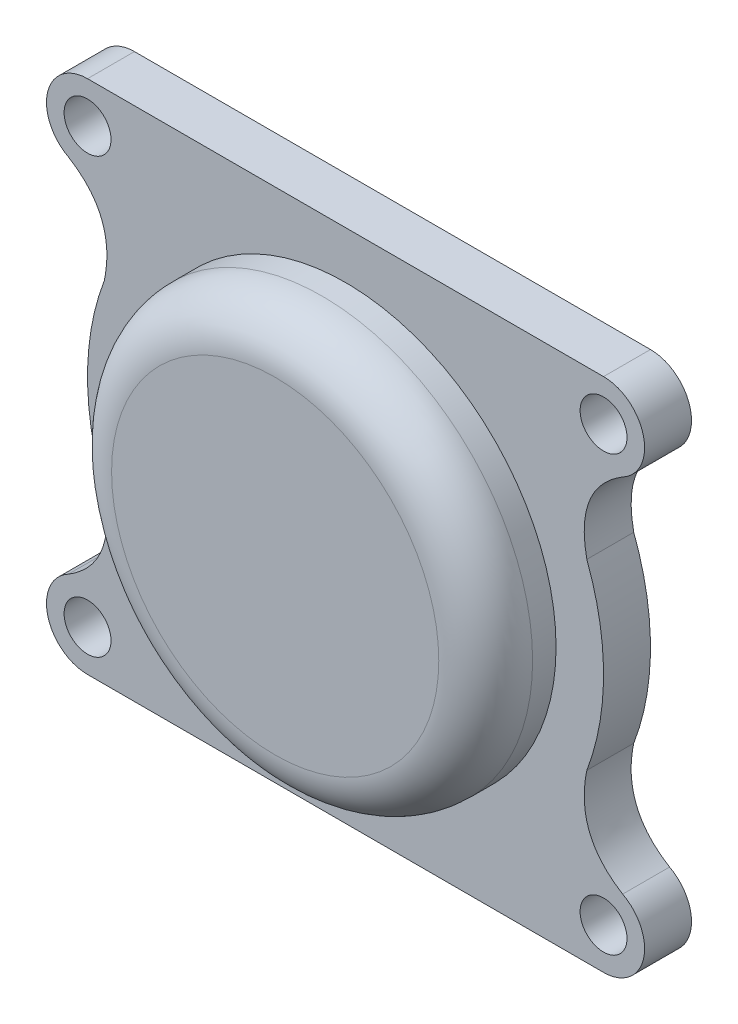
ISO-10303-21;
HEADER;
FILE_DESCRIPTION(('STEP AP214'),'2;1');
FILE_NAME('part.step','',(''),(''),'','','');
FILE_SCHEMA(('AUTOMOTIVE_DESIGN { 1 0 10303 214 1 1 1 1 }'));
ENDSEC;
DATA;
#1=APPLICATION_CONTEXT('core data for automotive mechanical design processes');
#2=APPLICATION_PROTOCOL_DEFINITION('international standard','automotive_design',2000,#1);
#3=PRODUCT_CONTEXT('',#1,'mechanical');
#4=PRODUCT('Part','Part','',(#3));
#5=PRODUCT_RELATED_PRODUCT_CATEGORY('part','',(#4));
#6=PRODUCT_DEFINITION_FORMATION('','',#4);
#7=PRODUCT_DEFINITION_CONTEXT('part definition',#1,'design');
#8=PRODUCT_DEFINITION('design','',#6,#7);
#9=PRODUCT_DEFINITION_SHAPE('','',#8);
#10=(LENGTH_UNIT() NAMED_UNIT(*) SI_UNIT(.MILLI.,.METRE.));
#11=(NAMED_UNIT(*) PLANE_ANGLE_UNIT() SI_UNIT($,.RADIAN.));
#12=(NAMED_UNIT(*) SI_UNIT($,.STERADIAN.) SOLID_ANGLE_UNIT());
#13=UNCERTAINTY_MEASURE_WITH_UNIT(LENGTH_MEASURE(1.E-05),#10,'distance_accuracy_value','');
#14=(GEOMETRIC_REPRESENTATION_CONTEXT(3) GLOBAL_UNCERTAINTY_ASSIGNED_CONTEXT((#13)) GLOBAL_UNIT_ASSIGNED_CONTEXT((#10,
#11,#12)) REPRESENTATION_CONTEXT('',''));
#15=CARTESIAN_POINT('',(0.,0.,0.));
#16=DIRECTION('',(0.,0.,1.));
#17=DIRECTION('',(1.,0.,0.));
#18=AXIS2_PLACEMENT_3D('',#15,#16,#17);
#19=CARTESIAN_POINT('',(-10.8666362557918,8.84990876735196,2.));
#20=DIRECTION('',(0.,0.,1.));
#21=DIRECTION('',(1.,0.,0.));
#22=AXIS2_PLACEMENT_3D('',#19,#20,#21);
#23=PLANE('',#22);
#24=CARTESIAN_POINT('',(-10.8666362557918,8.84990876735196,2.));
#25=DIRECTION('',(0.,0.,1.));
#26=DIRECTION('',(1.,0.,0.));
#27=AXIS2_PLACEMENT_3D('',#24,#25,#26);
#28=CIRCLE('',#27,1.);
#29=CARTESIAN_POINT('',(-9.86663625579182,8.84990876735196,2.));
#30=VERTEX_POINT('',#29);
#31=EDGE_CURVE('E341',#30,#30,#28,.T.);
#32=ORIENTED_EDGE('',*,*,#31,.F.);
#33=EDGE_LOOP('',(#32));
#34=FACE_BOUND('',#33,.T.);
#35=CARTESIAN_POINT('',(-10.8666362557918,-9.65009123264805,2.));
#36=DIRECTION('',(0.,0.,1.));
#37=DIRECTION('',(1.,0.,0.));
#38=AXIS2_PLACEMENT_3D('',#35,#36,#37);
#39=CIRCLE('',#38,0.999999999999998);
#40=CARTESIAN_POINT('',(-9.86663625579182,-9.65009123264805,2.));
#41=VERTEX_POINT('',#40);
#42=EDGE_CURVE('E166',#41,#41,#39,.T.);
#43=ORIENTED_EDGE('',*,*,#42,.F.);
#44=EDGE_LOOP('',(#43));
#45=FACE_BOUND('',#44,.T.);
#46=CARTESIAN_POINT('',(-10.8666362557918,8.84990876735196,2.));
#47=DIRECTION('',(0.,0.,1.));
#48=DIRECTION('',(1.,0.,0.));
#49=AXIS2_PLACEMENT_3D('',#46,#47,#48);
#50=CIRCLE('',#49,1.75000000003128);
#51=CARTESIAN_POINT('',(-10.8666362557918,10.5999087673832,2.));
#52=VERTEX_POINT('',#51);
#53=CARTESIAN_POINT('',(-11.6821574732259,7.30154668296523,2.));
#54=VERTEX_POINT('',#53);
#55=EDGE_CURVE('E205',#52,#54,#50,.T.);
#56=ORIENTED_EDGE('',*,*,#55,.T.);
#57=CARTESIAN_POINT('',(-896790.598267621,-442476.793929693,2.));
#58=CARTESIAN_POINT('',(895703.235486702,444637.410012307,2.));
#59=CARTESIAN_POINT('',(-894657.315377021,-446774.30900078,2.));
#60=B_SPLINE_CURVE_WITH_KNOTS('',2,(#57,#58,#59),.UNSPECIFIED.,.F.,.F.,(3,3),(0.,1.),.UNSPECIFIED.);
#61=CARTESIAN_POINT('',(-10.1540505189162,3.4946626448175,2.));
#62=VERTEX_POINT('',#61);
#63=EDGE_CURVE('E110',#54,#62,#60,.T.);
#64=ORIENTED_EDGE('',*,*,#63,.T.);
#65=CARTESIAN_POINT('',(0.133363744208179,-0.400091232648048,2.));
#66=DIRECTION('',(0.,0.,1.));
#67=DIRECTION('',(1.,0.,0.));
#68=AXIS2_PLACEMENT_3D('',#65,#66,#67);
#69=CIRCLE('',#68,10.9999999994168);
#70=CARTESIAN_POINT('',(-10.1540505353681,-4.29484505079547,2.));
#71=VERTEX_POINT('',#70);
#72=EDGE_CURVE('E305',#62,#71,#69,.T.);
#73=ORIENTED_EDGE('',*,*,#72,.T.);
#74=CARTESIAN_POINT('',(-894657.315377453,446773.508817446,2.));
#75=CARTESIAN_POINT('',(895703.235486702,-444638.210194769,2.));
#76=CARTESIAN_POINT('',(-896790.598267197,442475.993748083,2.));
#77=B_SPLINE_CURVE_WITH_KNOTS('',2,(#74,#75,#76),.UNSPECIFIED.,.F.,.F.,(3,3),(0.,1.),.UNSPECIFIED.);
#78=CARTESIAN_POINT('',(-11.6821574745311,-8.10172914910089,2.));
#79=VERTEX_POINT('',#78);
#80=EDGE_CURVE('E300',#71,#79,#77,.T.);
#81=ORIENTED_EDGE('',*,*,#80,.T.);
#82=CARTESIAN_POINT('',(-10.8666362557918,-9.65009123264805,2.));
#83=DIRECTION('',(0.,0.,1.));
#84=DIRECTION('',(1.,0.,0.));
#85=AXIS2_PLACEMENT_3D('',#82,#83,#84);
#86=CIRCLE('',#85,1.74999999999442);
#87=CARTESIAN_POINT('',(-10.8666362557918,-11.400091232643,2.));
#88=VERTEX_POINT('',#87);
#89=EDGE_CURVE('E298',#79,#88,#86,.T.);
#90=ORIENTED_EDGE('',*,*,#89,.T.);
#91=DIRECTION('',(1.,-2.31270179774544E-13,0.));
#92=VECTOR('',#91,1.);
#93=CARTESIAN_POINT('',(-10.8666362557918,-11.400091232643,2.));
#94=LINE('',#93,#92);
#95=CARTESIAN_POINT('',(11.1333637442082,-11.4000912326599,2.));
#96=VERTEX_POINT('',#95);
#97=EDGE_CURVE('E296',#88,#96,#94,.T.);
#98=ORIENTED_EDGE('',*,*,#97,.T.);
#99=CARTESIAN_POINT('',(11.1333637442082,-9.65009123264805,2.));
#100=DIRECTION('',(0.,0.,1.));
#101=DIRECTION('',(1.,0.,0.));
#102=AXIS2_PLACEMENT_3D('',#99,#100,#101);
#103=CIRCLE('',#102,1.75000000001188);
#104=CARTESIAN_POINT('',(11.9488849615484,-8.10172914834861,2.));
#105=VERTEX_POINT('',#104);
#106=EDGE_CURVE('E291',#96,#105,#103,.T.);
#107=ORIENTED_EDGE('',*,*,#106,.T.);
#108=CARTESIAN_POINT('',(896790.86499509,442475.993747267,2.));
#109=CARTESIAN_POINT('',(-895702.968759215,-444638.210194769,2.));
#110=CARTESIAN_POINT('',(894657.582104532,446773.508818268,2.));
#111=B_SPLINE_CURVE_WITH_KNOTS('',2,(#108,#109,#110),.UNSPECIFIED.,.F.,.F.,(3,3),(0.,1.),.UNSPECIFIED.);
#112=CARTESIAN_POINT('',(10.420778007214,-4.29484511008255,2.));
#113=VERTEX_POINT('',#112);
#114=EDGE_CURVE('E286',#105,#113,#111,.T.);
#115=ORIENTED_EDGE('',*,*,#114,.T.);
#116=CARTESIAN_POINT('',(0.133363744208179,-0.400091232648048,2.));
#117=DIRECTION('',(0.,0.,1.));
#118=DIRECTION('',(1.,0.,0.));
#119=AXIS2_PLACEMENT_3D('',#116,#117,#118);
#120=CIRCLE('',#119,10.9999999992948);
#121=CARTESIAN_POINT('',(10.4207780235742,3.49466258545728,2.));
#122=VERTEX_POINT('',#121);
#123=EDGE_CURVE('E141',#113,#122,#120,.T.);
#124=ORIENTED_EDGE('',*,*,#123,.T.);
#125=CARTESIAN_POINT('',(894657.582104965,-446774.308999863,2.));
#126=CARTESIAN_POINT('',(-895702.968759213,444637.410012306,2.));
#127=CARTESIAN_POINT('',(896790.864994659,-442476.793930601,2.));
#128=B_SPLINE_CURVE_WITH_KNOTS('',2,(#125,#126,#127),.UNSPECIFIED.,.F.,.F.,(3,3),(0.,1.),.UNSPECIFIED.);
#129=CARTESIAN_POINT('',(11.948884962921,7.30154668376602,2.));
#130=VERTEX_POINT('',#129);
#131=EDGE_CURVE('E135',#122,#130,#128,.T.);
#132=ORIENTED_EDGE('',*,*,#131,.T.);
#133=CARTESIAN_POINT('',(11.1333637442082,8.84990876735196,2.));
#134=DIRECTION('',(0.,0.,1.));
#135=DIRECTION('',(1.,0.,0.));
#136=AXIS2_PLACEMENT_3D('',#133,#134,#135);
#137=CIRCLE('',#136,1.75000000001643);
#138=CARTESIAN_POINT('',(11.1333637442082,10.5999087673483,2.));
#139=VERTEX_POINT('',#138);
#140=EDGE_CURVE('E139',#130,#139,#137,.T.);
#141=ORIENTED_EDGE('',*,*,#140,.T.);
#142=DIRECTION('',(-1.,1.58900670399476E-12,0.));
#143=VECTOR('',#142,1.);
#144=CARTESIAN_POINT('',(11.1333637442082,10.5999087673483,2.));
#145=LINE('',#144,#143);
#146=EDGE_CURVE('E54',#139,#52,#145,.T.);
#147=ORIENTED_EDGE('',*,*,#146,.T.);
#148=EDGE_LOOP('',(#56,#64,#73,#81,#90,#98,#107,#115,#124,#132,#141,#147));
#149=FACE_BOUND('',#148,.T.);
#150=CARTESIAN_POINT('',(11.1333637442082,-9.65009123264805,2.));
#151=DIRECTION('',(0.,0.,1.));
#152=DIRECTION('',(1.,0.,0.));
#153=AXIS2_PLACEMENT_3D('',#150,#151,#152);
#154=CIRCLE('',#153,1.);
#155=CARTESIAN_POINT('',(12.1333637442082,-9.65009123264805,2.));
#156=VERTEX_POINT('',#155);
#157=EDGE_CURVE('E335',#156,#156,#154,.T.);
#158=ORIENTED_EDGE('',*,*,#157,.F.);
#159=EDGE_LOOP('',(#158));
#160=FACE_BOUND('',#159,.T.);
#161=CARTESIAN_POINT('',(11.1333637442082,8.84990876735196,2.));
#162=DIRECTION('',(0.,0.,1.));
#163=DIRECTION('',(1.,0.,0.));
#164=AXIS2_PLACEMENT_3D('',#161,#162,#163);
#165=CIRCLE('',#164,1.00000000000001);
#166=CARTESIAN_POINT('',(12.1333637442082,8.84990876735196,2.));
#167=VERTEX_POINT('',#166);
#168=EDGE_CURVE('E347',#167,#167,#165,.T.);
#169=ORIENTED_EDGE('',*,*,#168,.F.);
#170=EDGE_LOOP('',(#169));
#171=FACE_BOUND('',#170,.T.);
#172=CARTESIAN_POINT('',(0.133363744208179,-0.400091232648048,2.));
#173=DIRECTION('',(0.,0.,1.));
#174=DIRECTION('',(1.,0.,0.));
#175=AXIS2_PLACEMENT_3D('',#172,#173,#174);
#176=CIRCLE('',#175,8.975);
#177=CARTESIAN_POINT('',(9.10836374420817,-0.400091232648048,2.));
#178=VERTEX_POINT('',#177);
#179=EDGE_CURVE('E358',#178,#178,#176,.T.);
#180=ORIENTED_EDGE('',*,*,#179,.F.);
#181=EDGE_LOOP('',(#180));
#182=FACE_BOUND('',#181,.T.);
#183=ADVANCED_FACE('F37',(#34,#45,#149,#160,#171,#182),#23,.T.);
#184=CARTESIAN_POINT('',(-10.8666362557918,8.84990876735196,0.));
#185=DIRECTION('',(0.,0.,1.));
#186=DIRECTION('',(1.,0.,0.));
#187=AXIS2_PLACEMENT_3D('',#184,#185,#186);
#188=PLANE('',#187);
#189=CARTESIAN_POINT('',(-10.8666362557918,8.84990876735196,0.));
#190=DIRECTION('',(0.,0.,1.));
#191=DIRECTION('',(1.,0.,0.));
#192=AXIS2_PLACEMENT_3D('',#189,#190,#191);
#193=CIRCLE('',#192,1.75000000003128);
#194=CARTESIAN_POINT('',(-10.8666362557918,10.5999087673832,0.));
#195=VERTEX_POINT('',#194);
#196=CARTESIAN_POINT('',(-11.6821574732259,7.30154668296523,0.));
#197=VERTEX_POINT('',#196);
#198=EDGE_CURVE('E162',#195,#197,#193,.T.);
#199=ORIENTED_EDGE('',*,*,#198,.F.);
#200=DIRECTION('',(-1.,1.58900670399476E-12,0.));
#201=VECTOR('',#200,1.);
#202=CARTESIAN_POINT('',(11.1333637442082,10.5999087673483,0.));
#203=LINE('',#202,#201);
#204=CARTESIAN_POINT('',(11.1333637442082,10.5999087673483,0.));
#205=VERTEX_POINT('',#204);
#206=EDGE_CURVE('E101',#205,#195,#203,.T.);
#207=ORIENTED_EDGE('',*,*,#206,.F.);
#208=CARTESIAN_POINT('',(11.1333637442082,8.84990876735196,0.));
#209=DIRECTION('',(0.,0.,1.));
#210=DIRECTION('',(1.,0.,0.));
#211=AXIS2_PLACEMENT_3D('',#208,#209,#210);
#212=CIRCLE('',#211,1.75000000001643);
#213=CARTESIAN_POINT('',(11.948884962921,7.30154668376602,0.));
#214=VERTEX_POINT('',#213);
#215=EDGE_CURVE('E95',#214,#205,#212,.T.);
#216=ORIENTED_EDGE('',*,*,#215,.F.);
#217=CARTESIAN_POINT('',(894657.582104965,-446774.308999863,0.));
#218=CARTESIAN_POINT('',(-895702.968759213,444637.410012306,0.));
#219=CARTESIAN_POINT('',(896790.864994659,-442476.793930601,0.));
#220=B_SPLINE_CURVE_WITH_KNOTS('',2,(#217,#218,#219),.UNSPECIFIED.,.F.,.F.,(3,3),(0.,1.),.UNSPECIFIED.);
#221=CARTESIAN_POINT('',(10.4207780235742,3.49466258545728,0.));
#222=VERTEX_POINT('',#221);
#223=EDGE_CURVE('E149',#222,#214,#220,.T.);
#224=ORIENTED_EDGE('',*,*,#223,.F.);
#225=CARTESIAN_POINT('',(0.133363744208179,-0.400091232648048,0.));
#226=DIRECTION('',(0.,0.,1.));
#227=DIRECTION('',(1.,0.,0.));
#228=AXIS2_PLACEMENT_3D('',#225,#226,#227);
#229=CIRCLE('',#228,10.9999999992948);
#230=CARTESIAN_POINT('',(10.420778007214,-4.29484511008255,0.));
#231=VERTEX_POINT('',#230);
#232=EDGE_CURVE('E192',#231,#222,#229,.T.);
#233=ORIENTED_EDGE('',*,*,#232,.F.);
#234=CARTESIAN_POINT('',(896790.86499509,442475.993747267,0.));
#235=CARTESIAN_POINT('',(-895702.968759215,-444638.210194769,0.));
#236=CARTESIAN_POINT('',(894657.582104532,446773.508818268,0.));
#237=B_SPLINE_CURVE_WITH_KNOTS('',2,(#234,#235,#236),.UNSPECIFIED.,.F.,.F.,(3,3),(0.,1.),.UNSPECIFIED.);
#238=CARTESIAN_POINT('',(11.9488849615484,-8.10172914834861,0.));
#239=VERTEX_POINT('',#238);
#240=EDGE_CURVE('E188',#239,#231,#237,.T.);
#241=ORIENTED_EDGE('',*,*,#240,.F.);
#242=CARTESIAN_POINT('',(11.1333637442082,-9.65009123264805,0.));
#243=DIRECTION('',(0.,0.,1.));
#244=DIRECTION('',(1.,0.,0.));
#245=AXIS2_PLACEMENT_3D('',#242,#243,#244);
#246=CIRCLE('',#245,1.75000000001188);
#247=CARTESIAN_POINT('',(11.1333637442082,-11.4000912326599,0.));
#248=VERTEX_POINT('',#247);
#249=EDGE_CURVE('E186',#248,#239,#246,.T.);
#250=ORIENTED_EDGE('',*,*,#249,.F.);
#251=DIRECTION('',(1.,-2.31270179774544E-13,0.));
#252=VECTOR('',#251,1.);
#253=CARTESIAN_POINT('',(-10.8666362557918,-11.400091232643,0.));
#254=LINE('',#253,#252);
#255=CARTESIAN_POINT('',(-10.8666362557918,-11.400091232643,0.));
#256=VERTEX_POINT('',#255);
#257=EDGE_CURVE('E184',#256,#248,#254,.T.);
#258=ORIENTED_EDGE('',*,*,#257,.F.);
#259=CARTESIAN_POINT('',(-10.8666362557918,-9.65009123264805,0.));
#260=DIRECTION('',(0.,0.,1.));
#261=DIRECTION('',(1.,0.,0.));
#262=AXIS2_PLACEMENT_3D('',#259,#260,#261);
#263=CIRCLE('',#262,1.74999999999442);
#264=CARTESIAN_POINT('',(-11.6821574745311,-8.10172914910089,0.));
#265=VERTEX_POINT('',#264);
#266=EDGE_CURVE('E179',#265,#256,#263,.T.);
#267=ORIENTED_EDGE('',*,*,#266,.F.);
#268=CARTESIAN_POINT('',(-894657.315377453,446773.508817446,0.));
#269=CARTESIAN_POINT('',(895703.235486702,-444638.210194769,0.));
#270=CARTESIAN_POINT('',(-896790.598267197,442475.993748083,0.));
#271=B_SPLINE_CURVE_WITH_KNOTS('',2,(#268,#269,#270),.UNSPECIFIED.,.F.,.F.,(3,3),(0.,1.),.UNSPECIFIED.);
#272=CARTESIAN_POINT('',(-10.1540505353681,-4.29484505079547,0.));
#273=VERTEX_POINT('',#272);
#274=EDGE_CURVE('E175',#273,#265,#271,.T.);
#275=ORIENTED_EDGE('',*,*,#274,.F.);
#276=CARTESIAN_POINT('',(0.133363744208179,-0.400091232648048,0.));
#277=DIRECTION('',(0.,0.,1.));
#278=DIRECTION('',(1.,0.,0.));
#279=AXIS2_PLACEMENT_3D('',#276,#277,#278);
#280=CIRCLE('',#279,10.9999999994168);
#281=CARTESIAN_POINT('',(-10.1540505189162,3.4946626448175,0.));
#282=VERTEX_POINT('',#281);
#283=EDGE_CURVE('E170',#282,#273,#280,.T.);
#284=ORIENTED_EDGE('',*,*,#283,.F.);
#285=CARTESIAN_POINT('',(-896790.598267621,-442476.793929693,0.));
#286=CARTESIAN_POINT('',(895703.235486702,444637.410012307,0.));
#287=CARTESIAN_POINT('',(-894657.315377021,-446774.30900078,0.));
#288=B_SPLINE_CURVE_WITH_KNOTS('',2,(#285,#286,#287),.UNSPECIFIED.,.F.,.F.,(3,3),(0.,1.),.UNSPECIFIED.);
#289=EDGE_CURVE('E165',#197,#282,#288,.T.);
#290=ORIENTED_EDGE('',*,*,#289,.F.);
#291=EDGE_LOOP('',(#199,#207,#216,#224,#233,#241,#250,#258,#267,#275,#284,#290));
#292=FACE_BOUND('',#291,.T.);
#293=CARTESIAN_POINT('',(-10.8666362557918,-9.65009123264805,0.));
#294=DIRECTION('',(0.,0.,1.));
#295=DIRECTION('',(1.,0.,0.));
#296=AXIS2_PLACEMENT_3D('',#293,#294,#295);
#297=CIRCLE('',#296,0.999999999999998);
#298=CARTESIAN_POINT('',(-9.86663625579182,-9.65009123264805,0.));
#299=VERTEX_POINT('',#298);
#300=EDGE_CURVE('E332',#299,#299,#297,.T.);
#301=ORIENTED_EDGE('',*,*,#300,.T.);
#302=EDGE_LOOP('',(#301));
#303=FACE_BOUND('',#302,.T.);
#304=CARTESIAN_POINT('',(11.1333637442082,-9.65009123264805,0.));
#305=DIRECTION('',(0.,0.,1.));
#306=DIRECTION('',(1.,0.,0.));
#307=AXIS2_PLACEMENT_3D('',#304,#305,#306);
#308=CIRCLE('',#307,1.);
#309=CARTESIAN_POINT('',(12.1333637442082,-9.65009123264805,0.));
#310=VERTEX_POINT('',#309);
#311=EDGE_CURVE('E338',#310,#310,#308,.T.);
#312=ORIENTED_EDGE('',*,*,#311,.T.);
#313=EDGE_LOOP('',(#312));
#314=FACE_BOUND('',#313,.T.);
#315=CARTESIAN_POINT('',(-10.8666362557918,8.84990876735196,0.));
#316=DIRECTION('',(0.,0.,1.));
#317=DIRECTION('',(1.,0.,0.));
#318=AXIS2_PLACEMENT_3D('',#315,#316,#317);
#319=CIRCLE('',#318,1.);
#320=CARTESIAN_POINT('',(-9.86663625579182,8.84990876735196,0.));
#321=VERTEX_POINT('',#320);
#322=EDGE_CURVE('E344',#321,#321,#319,.T.);
#323=ORIENTED_EDGE('',*,*,#322,.T.);
#324=EDGE_LOOP('',(#323));
#325=FACE_BOUND('',#324,.T.);
#326=CARTESIAN_POINT('',(11.1333637442082,8.84990876735196,0.));
#327=DIRECTION('',(0.,0.,1.));
#328=DIRECTION('',(1.,0.,0.));
#329=AXIS2_PLACEMENT_3D('',#326,#327,#328);
#330=CIRCLE('',#329,1.00000000000001);
#331=CARTESIAN_POINT('',(12.1333637442082,8.84990876735196,0.));
#332=VERTEX_POINT('',#331);
#333=EDGE_CURVE('E350',#332,#332,#330,.T.);
#334=ORIENTED_EDGE('',*,*,#333,.T.);
#335=EDGE_LOOP('',(#334));
#336=FACE_BOUND('',#335,.T.);
#337=CARTESIAN_POINT('',(0.133363744208179,-0.400091232648048,0.));
#338=DIRECTION('',(0.,0.,1.));
#339=DIRECTION('',(1.,0.,0.));
#340=AXIS2_PLACEMENT_3D('',#337,#338,#339);
#341=CIRCLE('',#340,7.975);
#342=CARTESIAN_POINT('',(8.10836374420817,-0.400091232648048,0.));
#343=VERTEX_POINT('',#342);
#344=EDGE_CURVE('E353',#343,#343,#341,.T.);
#345=ORIENTED_EDGE('',*,*,#344,.T.);
#346=EDGE_LOOP('',(#345));
#347=FACE_BOUND('',#346,.T.);
#348=ADVANCED_FACE('F253',(#292,#303,#314,#325,#336,#347),#188,.F.);
#349=CARTESIAN_POINT('',(-10.8666362557918,8.84990876735196,2.));
#350=DIRECTION('',(0.,0.,-1.));
#351=DIRECTION('',(-1.,0.,0.));
#352=AXIS2_PLACEMENT_3D('',#349,#350,#351);
#353=CYLINDRICAL_SURFACE('',#352,1.75000000003128);
#354=ORIENTED_EDGE('',*,*,#198,.T.);
#355=DIRECTION('',(0.,0.,-1.));
#356=VECTOR('',#355,1.);
#357=CARTESIAN_POINT('',(-11.6821574732259,7.30154668296523,2.));
#358=LINE('',#357,#356);
#359=EDGE_CURVE('E230',#54,#197,#358,.T.);
#360=ORIENTED_EDGE('',*,*,#359,.F.);
#361=ORIENTED_EDGE('',*,*,#55,.F.);
#362=DIRECTION('',(0.,0.,-1.));
#363=VECTOR('',#362,1.);
#364=CARTESIAN_POINT('',(-10.8666362557918,10.5999087673832,2.));
#365=LINE('',#364,#363);
#366=EDGE_CURVE('E155',#52,#195,#365,.T.);
#367=ORIENTED_EDGE('',*,*,#366,.T.);
#368=EDGE_LOOP('',(#354,#360,#361,#367));
#369=FACE_BOUND('',#368,.T.);
#370=ADVANCED_FACE('F259',(#369),#353,.T.);
#371=DIRECTION('',(0.,0.,-1.));
#372=VECTOR('',#371,1.);
#373=SURFACE_OF_LINEAR_EXTRUSION('',#60,#372);
#374=ORIENTED_EDGE('',*,*,#289,.T.);
#375=DIRECTION('',(0.,0.,-1.));
#376=VECTOR('',#375,1.);
#377=CARTESIAN_POINT('',(-10.1540505189162,3.4946626448175,2.));
#378=LINE('',#377,#376);
#379=EDGE_CURVE('E227',#62,#282,#378,.T.);
#380=ORIENTED_EDGE('',*,*,#379,.F.);
#381=ORIENTED_EDGE('',*,*,#63,.F.);
#382=ORIENTED_EDGE('',*,*,#359,.T.);
#383=EDGE_LOOP('',(#374,#380,#381,#382));
#384=FACE_BOUND('',#383,.T.);
#385=ADVANCED_FACE('F320',(#384),#373,.F.);
#386=CARTESIAN_POINT('',(0.133363744208179,-0.400091232648048,2.));
#387=DIRECTION('',(0.,0.,-1.));
#388=DIRECTION('',(-1.,0.,0.));
#389=AXIS2_PLACEMENT_3D('',#386,#387,#388);
#390=CYLINDRICAL_SURFACE('',#389,10.9999999994168);
#391=ORIENTED_EDGE('',*,*,#283,.T.);
#392=DIRECTION('',(0.,0.,-1.));
#393=VECTOR('',#392,1.);
#394=CARTESIAN_POINT('',(-10.1540505353681,-4.29484505079547,2.));
#395=LINE('',#394,#393);
#396=EDGE_CURVE('E224',#71,#273,#395,.T.);
#397=ORIENTED_EDGE('',*,*,#396,.F.);
#398=ORIENTED_EDGE('',*,*,#72,.F.);
#399=ORIENTED_EDGE('',*,*,#379,.T.);
#400=EDGE_LOOP('',(#391,#397,#398,#399));
#401=FACE_BOUND('',#400,.T.);
#402=ADVANCED_FACE('F316',(#401),#390,.T.);
#403=DIRECTION('',(0.,0.,-1.));
#404=VECTOR('',#403,1.);
#405=SURFACE_OF_LINEAR_EXTRUSION('',#77,#404);
#406=ORIENTED_EDGE('',*,*,#274,.T.);
#407=DIRECTION('',(0.,0.,-1.));
#408=VECTOR('',#407,1.);
#409=CARTESIAN_POINT('',(-11.6821574745311,-8.10172914910089,2.));
#410=LINE('',#409,#408);
#411=EDGE_CURVE('E221',#79,#265,#410,.T.);
#412=ORIENTED_EDGE('',*,*,#411,.F.);
#413=ORIENTED_EDGE('',*,*,#80,.F.);
#414=ORIENTED_EDGE('',*,*,#396,.T.);
#415=EDGE_LOOP('',(#406,#412,#413,#414));
#416=FACE_BOUND('',#415,.T.);
#417=ADVANCED_FACE('F311',(#416),#405,.F.);
#418=CARTESIAN_POINT('',(-10.8666362557918,-9.65009123264805,2.));
#419=DIRECTION('',(0.,0.,-1.));
#420=DIRECTION('',(-1.,0.,0.));
#421=AXIS2_PLACEMENT_3D('',#418,#419,#420);
#422=CYLINDRICAL_SURFACE('',#421,1.74999999999442);
#423=ORIENTED_EDGE('',*,*,#266,.T.);
#424=DIRECTION('',(0.,0.,-1.));
#425=VECTOR('',#424,1.);
#426=CARTESIAN_POINT('',(-10.8666362557918,-11.400091232643,2.));
#427=LINE('',#426,#425);
#428=EDGE_CURVE('E218',#88,#256,#427,.T.);
#429=ORIENTED_EDGE('',*,*,#428,.F.);
#430=ORIENTED_EDGE('',*,*,#89,.F.);
#431=ORIENTED_EDGE('',*,*,#411,.T.);
#432=EDGE_LOOP('',(#423,#429,#430,#431));
#433=FACE_BOUND('',#432,.T.);
#434=ADVANCED_FACE('F315',(#433),#422,.T.);
#435=CARTESIAN_POINT('',(-10.8666362557918,-11.400091232643,2.));
#436=DIRECTION('',(2.31270179774544E-13,1.,0.));
#437=DIRECTION('',(-1.,2.31270179774544E-13,0.));
#438=AXIS2_PLACEMENT_3D('',#435,#436,#437);
#439=PLANE('',#438);
#440=ORIENTED_EDGE('',*,*,#257,.T.);
#441=DIRECTION('',(0.,0.,-1.));
#442=VECTOR('',#441,1.);
#443=CARTESIAN_POINT('',(11.1333637442082,-11.4000912326599,2.));
#444=LINE('',#443,#442);
#445=EDGE_CURVE('E215',#96,#248,#444,.T.);
#446=ORIENTED_EDGE('',*,*,#445,.F.);
#447=ORIENTED_EDGE('',*,*,#97,.F.);
#448=ORIENTED_EDGE('',*,*,#428,.T.);
#449=EDGE_LOOP('',(#440,#446,#447,#448));
#450=FACE_BOUND('',#449,.T.);
#451=ADVANCED_FACE('F437',(#450),#439,.F.);
#452=CARTESIAN_POINT('',(11.1333637442082,-9.65009123264805,2.));
#453=DIRECTION('',(0.,0.,-1.));
#454=DIRECTION('',(-1.,0.,0.));
#455=AXIS2_PLACEMENT_3D('',#452,#453,#454);
#456=CYLINDRICAL_SURFACE('',#455,1.75000000001188);
#457=ORIENTED_EDGE('',*,*,#249,.T.);
#458=DIRECTION('',(0.,0.,-1.));
#459=VECTOR('',#458,1.);
#460=CARTESIAN_POINT('',(11.9488849615484,-8.10172914834861,2.));
#461=LINE('',#460,#459);
#462=EDGE_CURVE('E212',#105,#239,#461,.T.);
#463=ORIENTED_EDGE('',*,*,#462,.F.);
#464=ORIENTED_EDGE('',*,*,#106,.F.);
#465=ORIENTED_EDGE('',*,*,#445,.T.);
#466=EDGE_LOOP('',(#457,#463,#464,#465));
#467=FACE_BOUND('',#466,.T.);
#468=ADVANCED_FACE('F283',(#467),#456,.T.);
#469=DIRECTION('',(0.,0.,-1.));
#470=VECTOR('',#469,1.);
#471=SURFACE_OF_LINEAR_EXTRUSION('',#111,#470);
#472=ORIENTED_EDGE('',*,*,#240,.T.);
#473=DIRECTION('',(0.,0.,-1.));
#474=VECTOR('',#473,1.);
#475=CARTESIAN_POINT('',(10.420778007214,-4.29484511008255,2.));
#476=LINE('',#475,#474);
#477=EDGE_CURVE('E209',#113,#231,#476,.T.);
#478=ORIENTED_EDGE('',*,*,#477,.F.);
#479=ORIENTED_EDGE('',*,*,#114,.F.);
#480=ORIENTED_EDGE('',*,*,#462,.T.);
#481=EDGE_LOOP('',(#472,#478,#479,#480));
#482=FACE_BOUND('',#481,.T.);
#483=ADVANCED_FACE('F278',(#482),#471,.F.);
#484=CARTESIAN_POINT('',(0.133363744208179,-0.400091232648048,2.));
#485=DIRECTION('',(0.,0.,-1.));
#486=DIRECTION('',(-1.,0.,0.));
#487=AXIS2_PLACEMENT_3D('',#484,#485,#486);
#488=CYLINDRICAL_SURFACE('',#487,10.9999999992948);
#489=ORIENTED_EDGE('',*,*,#232,.T.);
#490=DIRECTION('',(0.,0.,-1.));
#491=VECTOR('',#490,1.);
#492=CARTESIAN_POINT('',(10.4207780235742,3.49466258545728,2.));
#493=LINE('',#492,#491);
#494=EDGE_CURVE('E150',#122,#222,#493,.T.);
#495=ORIENTED_EDGE('',*,*,#494,.F.);
#496=ORIENTED_EDGE('',*,*,#123,.F.);
#497=ORIENTED_EDGE('',*,*,#477,.T.);
#498=EDGE_LOOP('',(#489,#495,#496,#497));
#499=FACE_BOUND('',#498,.T.);
#500=ADVANCED_FACE('F275',(#499),#488,.T.);
#501=DIRECTION('',(0.,0.,-1.));
#502=VECTOR('',#501,1.);
#503=SURFACE_OF_LINEAR_EXTRUSION('',#128,#502);
#504=ORIENTED_EDGE('',*,*,#223,.T.);
#505=DIRECTION('',(0.,0.,-1.));
#506=VECTOR('',#505,1.);
#507=CARTESIAN_POINT('',(11.948884962921,7.30154668376602,2.));
#508=LINE('',#507,#506);
#509=EDGE_CURVE('E146',#130,#214,#508,.T.);
#510=ORIENTED_EDGE('',*,*,#509,.F.);
#511=ORIENTED_EDGE('',*,*,#131,.F.);
#512=ORIENTED_EDGE('',*,*,#494,.T.);
#513=EDGE_LOOP('',(#504,#510,#511,#512));
#514=FACE_BOUND('',#513,.T.);
#515=ADVANCED_FACE('F147',(#514),#503,.F.);
#516=CARTESIAN_POINT('',(11.1333637442082,8.84990876735196,2.));
#517=DIRECTION('',(0.,0.,-1.));
#518=DIRECTION('',(-1.,0.,0.));
#519=AXIS2_PLACEMENT_3D('',#516,#517,#518);
#520=CYLINDRICAL_SURFACE('',#519,1.75000000001643);
#521=ORIENTED_EDGE('',*,*,#215,.T.);
#522=DIRECTION('',(0.,0.,-1.));
#523=VECTOR('',#522,1.);
#524=CARTESIAN_POINT('',(11.1333637442082,10.5999087673483,2.));
#525=LINE('',#524,#523);
#526=EDGE_CURVE('E151',#139,#205,#525,.T.);
#527=ORIENTED_EDGE('',*,*,#526,.F.);
#528=ORIENTED_EDGE('',*,*,#140,.F.);
#529=ORIENTED_EDGE('',*,*,#509,.T.);
#530=EDGE_LOOP('',(#521,#527,#528,#529));
#531=FACE_BOUND('',#530,.T.);
#532=ADVANCED_FACE('F153',(#531),#520,.T.);
#533=CARTESIAN_POINT('',(11.1333637442082,10.5999087673483,2.));
#534=DIRECTION('',(-1.58900670399476E-12,-1.,0.));
#535=DIRECTION('',(1.,-1.58900670399476E-12,0.));
#536=AXIS2_PLACEMENT_3D('',#533,#534,#535);
#537=PLANE('',#536);
#538=ORIENTED_EDGE('',*,*,#206,.T.);
#539=ORIENTED_EDGE('',*,*,#366,.F.);
#540=ORIENTED_EDGE('',*,*,#146,.F.);
#541=ORIENTED_EDGE('',*,*,#526,.T.);
#542=EDGE_LOOP('',(#538,#539,#540,#541));
#543=FACE_BOUND('',#542,.T.);
#544=ADVANCED_FACE('F268',(#543),#537,.F.);
#545=CARTESIAN_POINT('',(-10.8666362557918,-9.65009123264805,2.));
#546=DIRECTION('',(0.,0.,-1.));
#547=DIRECTION('',(-1.,0.,0.));
#548=AXIS2_PLACEMENT_3D('',#545,#546,#547);
#549=CYLINDRICAL_SURFACE('',#548,0.999999999999998);
#550=ORIENTED_EDGE('',*,*,#42,.T.);
#551=EDGE_LOOP('',(#550));
#552=FACE_BOUND('',#551,.T.);
#553=ORIENTED_EDGE('',*,*,#300,.F.);
#554=EDGE_LOOP('',(#553));
#555=FACE_BOUND('',#554,.T.);
#556=ADVANCED_FACE('F265',(#552,#555),#549,.F.);
#557=CARTESIAN_POINT('',(11.1333637442082,-9.65009123264805,2.));
#558=DIRECTION('',(0.,0.,-1.));
#559=DIRECTION('',(-1.,0.,0.));
#560=AXIS2_PLACEMENT_3D('',#557,#558,#559);
#561=CYLINDRICAL_SURFACE('',#560,1.);
#562=ORIENTED_EDGE('',*,*,#157,.T.);
#563=EDGE_LOOP('',(#562));
#564=FACE_BOUND('',#563,.T.);
#565=ORIENTED_EDGE('',*,*,#311,.F.);
#566=EDGE_LOOP('',(#565));
#567=FACE_BOUND('',#566,.T.);
#568=ADVANCED_FACE('F383',(#564,#567),#561,.F.);
#569=CARTESIAN_POINT('',(-10.8666362557918,8.84990876735196,2.));
#570=DIRECTION('',(0.,0.,-1.));
#571=DIRECTION('',(-1.,0.,0.));
#572=AXIS2_PLACEMENT_3D('',#569,#570,#571);
#573=CYLINDRICAL_SURFACE('',#572,1.);
#574=ORIENTED_EDGE('',*,*,#31,.T.);
#575=EDGE_LOOP('',(#574));
#576=FACE_BOUND('',#575,.T.);
#577=ORIENTED_EDGE('',*,*,#322,.F.);
#578=EDGE_LOOP('',(#577));
#579=FACE_BOUND('',#578,.T.);
#580=ADVANCED_FACE('F380',(#576,#579),#573,.F.);
#581=CARTESIAN_POINT('',(11.1333637442082,8.84990876735196,2.));
#582=DIRECTION('',(0.,0.,-1.));
#583=DIRECTION('',(-1.,0.,0.));
#584=AXIS2_PLACEMENT_3D('',#581,#582,#583);
#585=CYLINDRICAL_SURFACE('',#584,1.00000000000001);
#586=ORIENTED_EDGE('',*,*,#168,.T.);
#587=EDGE_LOOP('',(#586));
#588=FACE_BOUND('',#587,.T.);
#589=ORIENTED_EDGE('',*,*,#333,.F.);
#590=EDGE_LOOP('',(#589));
#591=FACE_BOUND('',#590,.T.);
#592=ADVANCED_FACE('F374',(#588,#591),#585,.F.);
#593=CARTESIAN_POINT('',(0.133363744208179,-0.400091232648048,2.));
#594=DIRECTION('',(0.,0.,-1.));
#595=DIRECTION('',(-1.,0.,0.));
#596=AXIS2_PLACEMENT_3D('',#593,#594,#595);
#597=CYLINDRICAL_SURFACE('',#596,7.975);
#598=CARTESIAN_POINT('',(0.133363744208179,-0.400091232648048,2.));
#599=DIRECTION('',(0.,0.,1.));
#600=DIRECTION('',(1.,0.,0.));
#601=AXIS2_PLACEMENT_3D('',#598,#599,#600);
#602=CIRCLE('',#601,7.975);
#603=CARTESIAN_POINT('',(8.10836374420817,-0.400091232648048,2.));
#604=VERTEX_POINT('',#603);
#605=EDGE_CURVE('E46',#604,#604,#602,.T.);
#606=ORIENTED_EDGE('',*,*,#605,.T.);
#607=EDGE_LOOP('',(#606));
#608=FACE_BOUND('',#607,.T.);
#609=ORIENTED_EDGE('',*,*,#344,.F.);
#610=EDGE_LOOP('',(#609));
#611=FACE_BOUND('',#610,.T.);
#612=ADVANCED_FACE('F240',(#608,#611),#597,.F.);
#613=CARTESIAN_POINT('',(0.133363744208179,-0.400091232648048,4.));
#614=DIRECTION('',(0.,0.,-1.));
#615=DIRECTION('',(-1.,0.,0.));
#616=AXIS2_PLACEMENT_3D('',#613,#614,#615);
#617=CYLINDRICAL_SURFACE('',#616,8.975);
#618=CARTESIAN_POINT('',(0.133363744208179,-0.400091232648048,3.));
#619=DIRECTION('',(0.,0.,1.));
#620=DIRECTION('',(1.,0.,0.));
#621=AXIS2_PLACEMENT_3D('',#618,#619,#620);
#622=CIRCLE('',#621,8.975);
#623=CARTESIAN_POINT('',(9.10836374420817,-0.400091232648048,3.));
#624=VERTEX_POINT('',#623);
#625=EDGE_CURVE('E235',#624,#624,#622,.F.);
#626=ORIENTED_EDGE('',*,*,#625,.T.);
#627=EDGE_LOOP('',(#626));
#628=FACE_BOUND('',#627,.T.);
#629=ORIENTED_EDGE('',*,*,#179,.T.);
#630=EDGE_LOOP('',(#629));
#631=FACE_BOUND('',#630,.T.);
#632=ADVANCED_FACE('F362',(#628,#631),#617,.T.);
#633=CARTESIAN_POINT('',(0.133363744208179,-0.400091232648048,4.));
#634=DIRECTION('',(0.,0.,1.));
#635=DIRECTION('',(1.,0.,0.));
#636=AXIS2_PLACEMENT_3D('',#633,#634,#635);
#637=PLANE('',#636);
#638=CARTESIAN_POINT('',(0.133363744208179,-0.400091232648048,4.));
#639=DIRECTION('',(0.,0.,1.));
#640=DIRECTION('',(1.,0.,0.));
#641=AXIS2_PLACEMENT_3D('',#638,#639,#640);
#642=CIRCLE('',#641,5.975);
#643=CARTESIAN_POINT('',(6.10836374420817,-0.400091232648048,4.));
#644=VERTEX_POINT('',#643);
#645=EDGE_CURVE('E11',#644,#644,#642,.F.);
#646=ORIENTED_EDGE('',*,*,#645,.T.);
#647=EDGE_LOOP('',(#646));
#648=FACE_BOUND('',#647,.T.);
#649=ADVANCED_FACE('F365',(#648),#637,.F.);
#650=CARTESIAN_POINT('',(0.133363744208179,-0.400091232648048,5.));
#651=DIRECTION('',(0.,0.,1.));
#652=DIRECTION('',(1.,0.,0.));
#653=AXIS2_PLACEMENT_3D('',#650,#651,#652);
#654=PLANE('',#653);
#655=CARTESIAN_POINT('',(0.133363744208179,-0.400091232648048,5.));
#656=DIRECTION('',(0.,0.,1.));
#657=DIRECTION('',(1.,0.,0.));
#658=AXIS2_PLACEMENT_3D('',#655,#656,#657);
#659=CIRCLE('',#658,6.975);
#660=CARTESIAN_POINT('',(7.10836374420818,-0.400091232648048,5.));
#661=VERTEX_POINT('',#660);
#662=EDGE_CURVE('E232',#661,#661,#659,.T.);
#663=ORIENTED_EDGE('',*,*,#662,.T.);
#664=EDGE_LOOP('',(#663));
#665=FACE_BOUND('',#664,.T.);
#666=ADVANCED_FACE('F249',(#665),#654,.T.);
#667=CARTESIAN_POINT('',(0.133363744208179,-0.400091232648048,3.));
#668=DIRECTION('',(0.,0.,1.));
#669=DIRECTION('',(1.,0.,0.));
#670=AXIS2_PLACEMENT_3D('',#667,#668,#669);
#671=TOROIDAL_SURFACE('',#670,6.975,2.);
#672=ORIENTED_EDGE('',*,*,#625,.F.);
#673=EDGE_LOOP('',(#672));
#674=FACE_BOUND('',#673,.T.);
#675=ORIENTED_EDGE('',*,*,#662,.F.);
#676=EDGE_LOOP('',(#675));
#677=FACE_BOUND('',#676,.T.);
#678=ADVANCED_FACE('F244',(#674,#677),#671,.T.);
#679=CARTESIAN_POINT('',(0.133363744208179,-0.400091232648048,2.));
#680=DIRECTION('',(0.,0.,1.));
#681=DIRECTION('',(1.,0.,0.));
#682=AXIS2_PLACEMENT_3D('',#679,#680,#681);
#683=TOROIDAL_SURFACE('',#682,5.975,2.);
#684=ORIENTED_EDGE('',*,*,#645,.F.);
#685=EDGE_LOOP('',(#684));
#686=FACE_BOUND('',#685,.T.);
#687=ORIENTED_EDGE('',*,*,#605,.F.);
#688=EDGE_LOOP('',(#687));
#689=FACE_BOUND('',#688,.T.);
#690=ADVANCED_FACE('F39',(#686,#689),#683,.F.);
#691=CLOSED_SHELL('',(#183,#348,#370,#385,#402,#417,#434,#451,#468,#483,#500,#515,#532,#544,
#556,#568,#580,#592,#612,#632,#649,#666,#678,#690));
#692=MANIFOLD_SOLID_BREP('B2',#691);
#693=ADVANCED_BREP_SHAPE_REPRESENTATION('',(#18,#692),#14);
#694=SHAPE_DEFINITION_REPRESENTATION(#9,#693);
ENDSEC;
END-ISO-10303-21;
